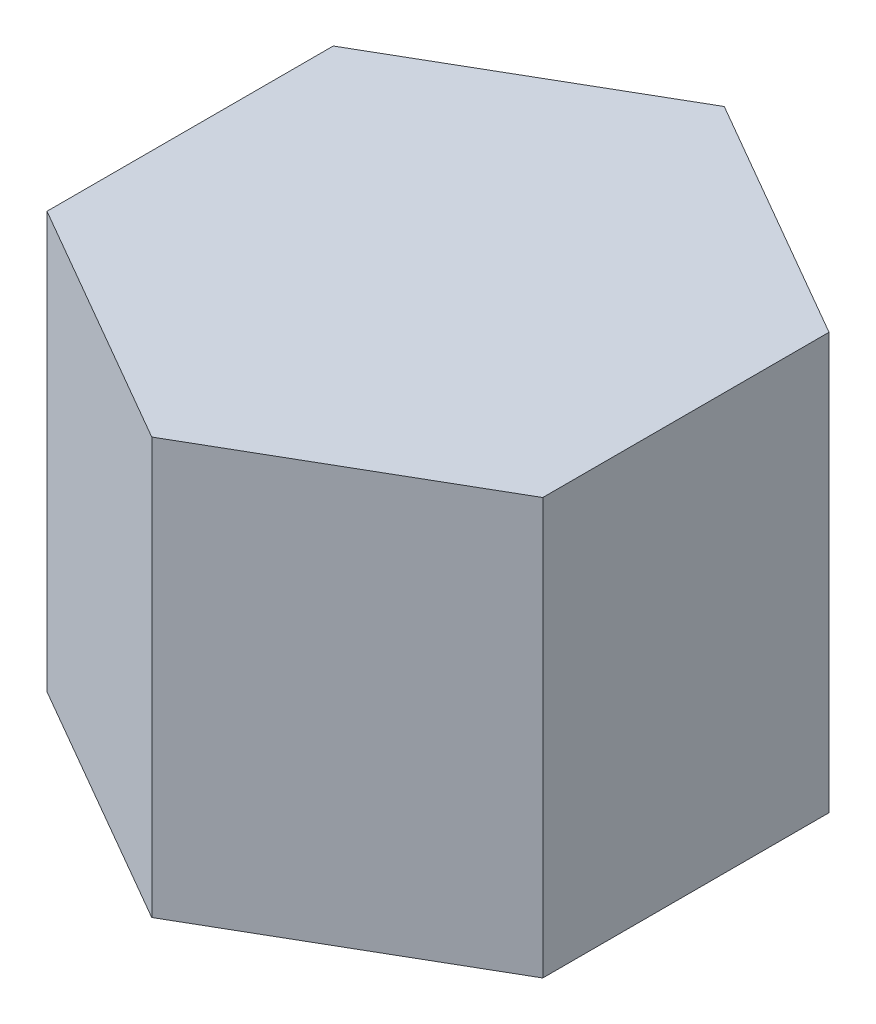
ISO-10303-21;
HEADER;
FILE_DESCRIPTION(('STEP AP214'),'2;1');
FILE_NAME('part.step','',(''),(''),'','','');
FILE_SCHEMA(('AUTOMOTIVE_DESIGN { 1 0 10303 214 1 1 1 1 }'));
ENDSEC;
DATA;
#1=APPLICATION_CONTEXT('core data for automotive mechanical design processes');
#2=APPLICATION_PROTOCOL_DEFINITION('international standard','automotive_design',2000,#1);
#3=PRODUCT_CONTEXT('',#1,'mechanical');
#4=PRODUCT('Part','Part','',(#3));
#5=PRODUCT_RELATED_PRODUCT_CATEGORY('part','',(#4));
#6=PRODUCT_DEFINITION_FORMATION('','',#4);
#7=PRODUCT_DEFINITION_CONTEXT('part definition',#1,'design');
#8=PRODUCT_DEFINITION('design','',#6,#7);
#9=PRODUCT_DEFINITION_SHAPE('','',#8);
#10=(LENGTH_UNIT() NAMED_UNIT(*) SI_UNIT(.MILLI.,.METRE.));
#11=(NAMED_UNIT(*) PLANE_ANGLE_UNIT() SI_UNIT($,.RADIAN.));
#12=(NAMED_UNIT(*) SI_UNIT($,.STERADIAN.) SOLID_ANGLE_UNIT());
#13=UNCERTAINTY_MEASURE_WITH_UNIT(LENGTH_MEASURE(1.E-05),#10,'distance_accuracy_value','');
#14=(GEOMETRIC_REPRESENTATION_CONTEXT(3) GLOBAL_UNCERTAINTY_ASSIGNED_CONTEXT((#13)) GLOBAL_UNIT_ASSIGNED_CONTEXT((#10,
#11,#12)) REPRESENTATION_CONTEXT('',''));
#15=CARTESIAN_POINT('',(0.,0.,0.));
#16=DIRECTION('',(0.,0.,1.));
#17=DIRECTION('',(1.,0.,0.));
#18=AXIS2_PLACEMENT_3D('',#15,#16,#17);
#19=CARTESIAN_POINT('',(203.339551417382,-147.556598747966,293.414022028063));
#20=DIRECTION('',(-0.500000000000096,0.,-0.866025403784383));
#21=DIRECTION('',(-0.866025403784383,0.,0.500000000000096));
#22=AXIS2_PLACEMENT_3D('',#19,#20,#21);
#23=PLANE('',#22);
#24=CARTESIAN_POINT('',(203.642660308706,-147.047793579175,293.239022028063));
#25=DIRECTION('',(-0.866025403784383,0.,0.500000000000096));
#26=VECTOR('',#25,1.);
#27=LINE('',#24,#26);
#28=CARTESIAN_POINT('',(203.642660308706,-147.047793579175,293.239022028063));
#29=VERTEX_POINT('',#28);
#30=CARTESIAN_POINT('',(203.339551417382,-147.047793579175,293.414022028063));
#31=VERTEX_POINT('',#30);
#32=EDGE_CURVE('E170',#29,#31,#27,.T.);
#33=ORIENTED_EDGE('',*,*,#32,.T.);
#34=CARTESIAN_POINT('',(203.339551417382,-147.556598747966,293.414022028063));
#35=DIRECTION('',(0.,1.,0.));
#36=VECTOR('',#35,1.);
#37=LINE('',#34,#36);
#38=CARTESIAN_POINT('',(203.339551417382,-147.556598747966,293.414022028063));
#39=VERTEX_POINT('',#38);
#40=EDGE_CURVE('E35',#39,#31,#37,.T.);
#41=ORIENTED_EDGE('',*,*,#40,.F.);
#42=CARTESIAN_POINT('',(203.642660308706,-147.556598747966,293.239022028063));
#43=DIRECTION('',(-0.866025403784383,0.,0.500000000000096));
#44=VECTOR('',#43,1.);
#45=LINE('',#42,#44);
#46=CARTESIAN_POINT('',(203.642660308706,-147.556598747966,293.239022028063));
#47=VERTEX_POINT('',#46);
#48=EDGE_CURVE('E159',#47,#39,#45,.T.);
#49=ORIENTED_EDGE('',*,*,#48,.F.);
#50=CARTESIAN_POINT('',(203.642660308706,-147.556598747966,293.239022028063));
#51=DIRECTION('',(0.,1.,0.));
#52=VECTOR('',#51,1.);
#53=LINE('',#50,#52);
#54=EDGE_CURVE('E10',#47,#29,#53,.T.);
#55=ORIENTED_EDGE('',*,*,#54,.T.);
#56=EDGE_LOOP('',(#33,#41,#49,#55));
#57=FACE_BOUND('',#56,.T.);
#58=ADVANCED_FACE('F16',(#57),#23,.F.);
#59=CARTESIAN_POINT('',(203.642660308706,-147.556598747966,291.594471220494));
#60=DIRECTION('',(-1.,0.,0.));
#61=DIRECTION('',(0.,-1.,0.));
#62=AXIS2_PLACEMENT_3D('',#59,#60,#61);
#63=PLANE('',#62);
#64=CARTESIAN_POINT('',(203.642660308706,-147.047793579175,292.889022028063));
#65=DIRECTION('',(0.,0.,1.));
#66=VECTOR('',#65,1.);
#67=LINE('',#64,#66);
#68=CARTESIAN_POINT('',(203.642660308706,-147.047793579175,292.889022028063));
#69=VERTEX_POINT('',#68);
#70=EDGE_CURVE('E167',#69,#29,#67,.T.);
#71=ORIENTED_EDGE('',*,*,#70,.T.);
#72=ORIENTED_EDGE('',*,*,#54,.F.);
#73=CARTESIAN_POINT('',(203.642660308706,-147.556598747966,292.889022028063));
#74=DIRECTION('',(0.,0.,1.));
#75=VECTOR('',#74,1.);
#76=LINE('',#73,#75);
#77=CARTESIAN_POINT('',(203.642660308706,-147.556598747966,292.889022028063));
#78=VERTEX_POINT('',#77);
#79=EDGE_CURVE('E156',#78,#47,#76,.T.);
#80=ORIENTED_EDGE('',*,*,#79,.F.);
#81=CARTESIAN_POINT('',(203.642660308706,-147.556598747966,292.889022028063));
#82=DIRECTION('',(0.,1.,0.));
#83=VECTOR('',#82,1.);
#84=LINE('',#81,#83);
#85=EDGE_CURVE('E27',#78,#69,#84,.T.);
#86=ORIENTED_EDGE('',*,*,#85,.T.);
#87=EDGE_LOOP('',(#71,#72,#80,#86));
#88=FACE_BOUND('',#87,.T.);
#89=ADVANCED_FACE('F189',(#88),#63,.F.);
#90=CARTESIAN_POINT('',(203.642660308706,-147.556598747966,292.889022028063));
#91=DIRECTION('',(-0.499999999999909,0.,0.866025403784491));
#92=DIRECTION('',(0.866025403784491,0.,0.499999999999909));
#93=AXIS2_PLACEMENT_3D('',#90,#91,#92);
#94=PLANE('',#93);
#95=CARTESIAN_POINT('',(203.339551417381,-147.047793579175,292.714022028063));
#96=DIRECTION('',(0.866025403784491,0.,0.499999999999909));
#97=VECTOR('',#96,1.);
#98=LINE('',#95,#97);
#99=CARTESIAN_POINT('',(203.339551417382,-147.047793579175,292.714022028063));
#100=VERTEX_POINT('',#99);
#101=EDGE_CURVE('E163',#100,#69,#98,.T.);
#102=ORIENTED_EDGE('',*,*,#101,.T.);
#103=ORIENTED_EDGE('',*,*,#85,.F.);
#104=CARTESIAN_POINT('',(203.339551417381,-147.556598747966,292.714022028063));
#105=DIRECTION('',(0.866025403784491,0.,0.499999999999909));
#106=VECTOR('',#105,1.);
#107=LINE('',#104,#106);
#108=CARTESIAN_POINT('',(203.339551417382,-147.556598747966,292.714022028063));
#109=VERTEX_POINT('',#108);
#110=EDGE_CURVE('E106',#109,#78,#107,.T.);
#111=ORIENTED_EDGE('',*,*,#110,.F.);
#112=CARTESIAN_POINT('',(203.339551417381,-147.556598747966,292.714022028063));
#113=DIRECTION('',(0.,1.,0.));
#114=VECTOR('',#113,1.);
#115=LINE('',#112,#114);
#116=EDGE_CURVE('E94',#109,#100,#115,.T.);
#117=ORIENTED_EDGE('',*,*,#116,.T.);
#118=EDGE_LOOP('',(#102,#103,#111,#117));
#119=FACE_BOUND('',#118,.T.);
#120=ADVANCED_FACE('F198',(#119),#94,.F.);
#121=CARTESIAN_POINT('',(203.339551417382,-147.556598747966,292.714022028063));
#122=DIRECTION('',(0.500000000000096,0.,0.866025403784383));
#123=DIRECTION('',(0.866025403784383,0.,-0.500000000000096));
#124=AXIS2_PLACEMENT_3D('',#121,#122,#123);
#125=PLANE('',#124);
#126=CARTESIAN_POINT('',(203.036442526057,-147.047793579175,292.889022028063));
#127=DIRECTION('',(0.866025403784383,0.,-0.500000000000096));
#128=VECTOR('',#127,1.);
#129=LINE('',#126,#128);
#130=CARTESIAN_POINT('',(203.036442526057,-147.047793579175,292.889022028063));
#131=VERTEX_POINT('',#130);
#132=EDGE_CURVE('E162',#131,#100,#129,.T.);
#133=ORIENTED_EDGE('',*,*,#132,.T.);
#134=ORIENTED_EDGE('',*,*,#116,.F.);
#135=CARTESIAN_POINT('',(203.036442526057,-147.556598747966,292.889022028063));
#136=DIRECTION('',(0.866025403784383,0.,-0.500000000000096));
#137=VECTOR('',#136,1.);
#138=LINE('',#135,#137);
#139=CARTESIAN_POINT('',(203.036442526057,-147.556598747966,292.889022028063));
#140=VERTEX_POINT('',#139);
#141=EDGE_CURVE('E98',#140,#109,#138,.T.);
#142=ORIENTED_EDGE('',*,*,#141,.F.);
#143=CARTESIAN_POINT('',(203.036442526057,-147.556598747966,292.889022028063));
#144=DIRECTION('',(0.,1.,0.));
#145=VECTOR('',#144,1.);
#146=LINE('',#143,#145);
#147=EDGE_CURVE('E79',#140,#131,#146,.T.);
#148=ORIENTED_EDGE('',*,*,#147,.T.);
#149=EDGE_LOOP('',(#133,#134,#142,#148));
#150=FACE_BOUND('',#149,.T.);
#151=ADVANCED_FACE('F100',(#150),#125,.F.);
#152=CARTESIAN_POINT('',(203.036442526057,-147.556598747966,291.594471220494));
#153=DIRECTION('',(1.,0.,0.));
#154=DIRECTION('',(0.,1.,0.));
#155=AXIS2_PLACEMENT_3D('',#152,#153,#154);
#156=PLANE('',#155);
#157=CARTESIAN_POINT('',(203.036442526057,-147.047793579175,293.239022028063));
#158=DIRECTION('',(0.,0.,-1.));
#159=VECTOR('',#158,1.);
#160=LINE('',#157,#159);
#161=CARTESIAN_POINT('',(203.036442526057,-147.047793579175,293.239022028063));
#162=VERTEX_POINT('',#161);
#163=EDGE_CURVE('E88',#162,#131,#160,.T.);
#164=ORIENTED_EDGE('',*,*,#163,.T.);
#165=ORIENTED_EDGE('',*,*,#147,.F.);
#166=CARTESIAN_POINT('',(203.036442526057,-147.556598747966,293.239022028063));
#167=DIRECTION('',(0.,0.,-1.));
#168=VECTOR('',#167,1.);
#169=LINE('',#166,#168);
#170=CARTESIAN_POINT('',(203.036442526057,-147.556598747966,293.239022028063));
#171=VERTEX_POINT('',#170);
#172=EDGE_CURVE('E84',#171,#140,#169,.T.);
#173=ORIENTED_EDGE('',*,*,#172,.F.);
#174=CARTESIAN_POINT('',(203.036442526057,-147.556598747966,293.239022028063));
#175=DIRECTION('',(0.,1.,0.));
#176=VECTOR('',#175,1.);
#177=LINE('',#174,#176);
#178=EDGE_CURVE('E58',#171,#162,#177,.T.);
#179=ORIENTED_EDGE('',*,*,#178,.T.);
#180=EDGE_LOOP('',(#164,#165,#173,#179));
#181=FACE_BOUND('',#180,.T.);
#182=ADVANCED_FACE('F82',(#181),#156,.F.);
#183=CARTESIAN_POINT('',(203.036442526057,-147.556598747966,293.239022028063));
#184=DIRECTION('',(0.499999999999978,0.,-0.866025403784452));
#185=DIRECTION('',(-0.866025403784452,0.,-0.499999999999978));
#186=AXIS2_PLACEMENT_3D('',#183,#184,#185);
#187=PLANE('',#186);
#188=CARTESIAN_POINT('',(203.339551417382,-147.047793579175,293.414022028063));
#189=DIRECTION('',(-0.866025403784452,0.,-0.499999999999978));
#190=VECTOR('',#189,1.);
#191=LINE('',#188,#190);
#192=EDGE_CURVE('E160',#31,#162,#191,.T.);
#193=ORIENTED_EDGE('',*,*,#192,.T.);
#194=ORIENTED_EDGE('',*,*,#178,.F.);
#195=CARTESIAN_POINT('',(203.339551417382,-147.556598747966,293.414022028063));
#196=DIRECTION('',(-0.866025403784452,0.,-0.499999999999978));
#197=VECTOR('',#196,1.);
#198=LINE('',#195,#197);
#199=EDGE_CURVE('E112',#39,#171,#198,.T.);
#200=ORIENTED_EDGE('',*,*,#199,.F.);
#201=ORIENTED_EDGE('',*,*,#40,.T.);
#202=EDGE_LOOP('',(#193,#194,#200,#201));
#203=FACE_BOUND('',#202,.T.);
#204=ADVANCED_FACE('F131',(#203),#187,.F.);
#205=CARTESIAN_POINT('',(206.491105863044,-147.556598747966,291.594471220494));
#206=DIRECTION('',(0.,1.,0.));
#207=DIRECTION('',(-1.,0.,0.));
#208=AXIS2_PLACEMENT_3D('',#205,#206,#207);
#209=PLANE('',#208);
#210=ORIENTED_EDGE('',*,*,#48,.T.);
#211=ORIENTED_EDGE('',*,*,#199,.T.);
#212=ORIENTED_EDGE('',*,*,#172,.T.);
#213=ORIENTED_EDGE('',*,*,#141,.T.);
#214=ORIENTED_EDGE('',*,*,#110,.T.);
#215=ORIENTED_EDGE('',*,*,#79,.T.);
#216=EDGE_LOOP('',(#210,#211,#212,#213,#214,#215));
#217=FACE_BOUND('',#216,.T.);
#218=ADVANCED_FACE('F111',(#217),#209,.F.);
#219=CARTESIAN_POINT('',(206.491105863044,-147.047793579175,291.594471220494));
#220=DIRECTION('',(0.,1.,0.));
#221=DIRECTION('',(-1.,0.,0.));
#222=AXIS2_PLACEMENT_3D('',#219,#220,#221);
#223=PLANE('',#222);
#224=ORIENTED_EDGE('',*,*,#32,.F.);
#225=ORIENTED_EDGE('',*,*,#70,.F.);
#226=ORIENTED_EDGE('',*,*,#101,.F.);
#227=ORIENTED_EDGE('',*,*,#132,.F.);
#228=ORIENTED_EDGE('',*,*,#163,.F.);
#229=ORIENTED_EDGE('',*,*,#192,.F.);
#230=EDGE_LOOP('',(#224,#225,#226,#227,#228,#229));
#231=FACE_BOUND('',#230,.T.);
#232=ADVANCED_FACE('F130',(#231),#223,.T.);
#233=CLOSED_SHELL('',(#58,#89,#120,#151,#182,#204,#218,#232));
#234=MANIFOLD_SOLID_BREP('B1',#233);
#235=ADVANCED_BREP_SHAPE_REPRESENTATION('',(#18,#234),#14);
#236=SHAPE_DEFINITION_REPRESENTATION(#9,#235);
ENDSEC;
END-ISO-10303-21;
